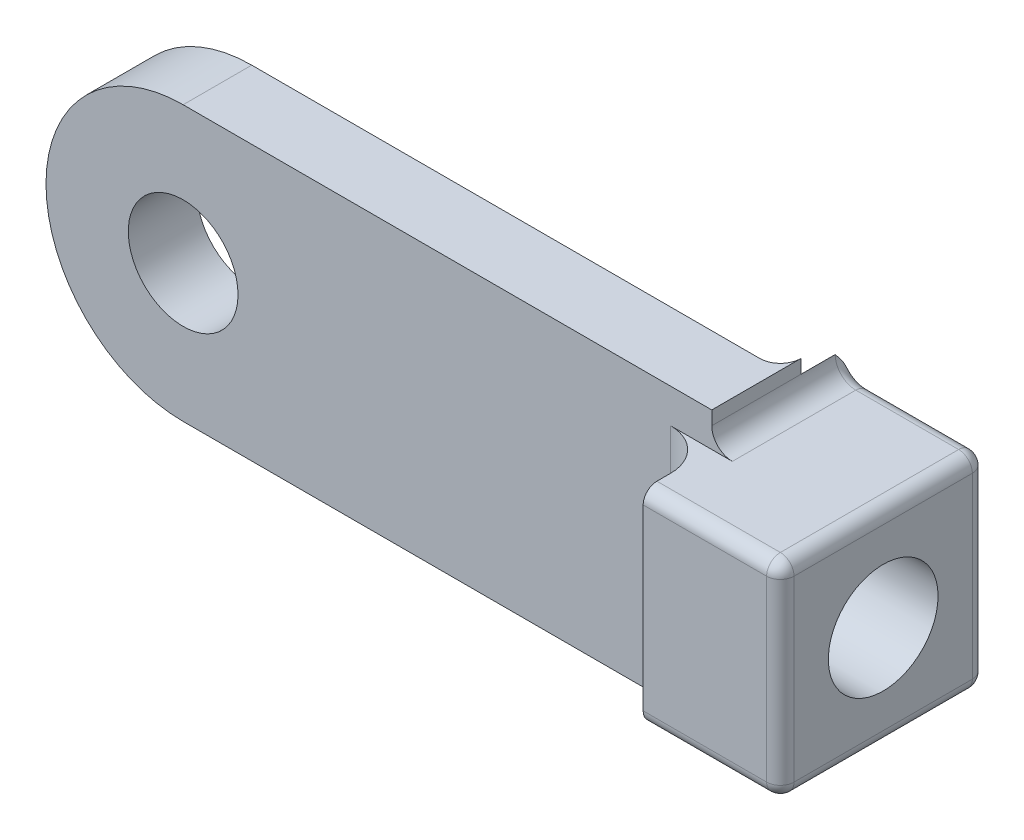
ISO-10303-21;
HEADER;
FILE_DESCRIPTION(('STEP AP214'),'2;1');
FILE_NAME('part.step','',(''),(''),'','','');
FILE_SCHEMA(('AUTOMOTIVE_DESIGN { 1 0 10303 214 1 1 1 1 }'));
ENDSEC;
DATA;
#1=APPLICATION_CONTEXT('core data for automotive mechanical design processes');
#2=APPLICATION_PROTOCOL_DEFINITION('international standard','automotive_design',2000,#1);
#3=PRODUCT_CONTEXT('',#1,'mechanical');
#4=PRODUCT('Part','Part','',(#3));
#5=PRODUCT_RELATED_PRODUCT_CATEGORY('part','',(#4));
#6=PRODUCT_DEFINITION_FORMATION('','',#4);
#7=PRODUCT_DEFINITION_CONTEXT('part definition',#1,'design');
#8=PRODUCT_DEFINITION('design','',#6,#7);
#9=PRODUCT_DEFINITION_SHAPE('','',#8);
#10=(LENGTH_UNIT() NAMED_UNIT(*) SI_UNIT(.MILLI.,.METRE.));
#11=(NAMED_UNIT(*) PLANE_ANGLE_UNIT() SI_UNIT($,.RADIAN.));
#12=(NAMED_UNIT(*) SI_UNIT($,.STERADIAN.) SOLID_ANGLE_UNIT());
#13=UNCERTAINTY_MEASURE_WITH_UNIT(LENGTH_MEASURE(1.E-05),#10,'distance_accuracy_value','');
#14=(GEOMETRIC_REPRESENTATION_CONTEXT(3) GLOBAL_UNCERTAINTY_ASSIGNED_CONTEXT((#13)) GLOBAL_UNIT_ASSIGNED_CONTEXT((#10,
#11,#12)) REPRESENTATION_CONTEXT('',''));
#15=CARTESIAN_POINT('',(0.,0.,0.));
#16=DIRECTION('',(0.,0.,1.));
#17=DIRECTION('',(1.,0.,0.));
#18=AXIS2_PLACEMENT_3D('',#15,#16,#17);
#19=CARTESIAN_POINT('',(16.0415717466549,10.,0.));
#20=DIRECTION('',(-1.,0.,0.));
#21=DIRECTION('',(0.,0.,1.));
#22=AXIS2_PLACEMENT_3D('',#19,#20,#21);
#23=PLANE('',#22);
#24=DIRECTION('',(0.,0.,1.));
#25=VECTOR('',#24,1.);
#26=CARTESIAN_POINT('',(16.0415717466549,-10.,0.));
#27=LINE('',#26,#25);
#28=CARTESIAN_POINT('',(16.0415717466549,-10.,-1.49999580710284));
#29=VERTEX_POINT('',#28);
#30=CARTESIAN_POINT('',(16.0415717466549,-10.,5.));
#31=VERTEX_POINT('',#30);
#32=EDGE_CURVE('E188',#29,#31,#27,.T.);
#33=ORIENTED_EDGE('',*,*,#32,.F.);
#34=DIRECTION('',(0.,1.,0.));
#35=VECTOR('',#34,1.);
#36=CARTESIAN_POINT('',(16.0415717466549,-9.49999999999999,-1.5));
#37=LINE('',#36,#35);
#38=CARTESIAN_POINT('',(16.0415717466549,-8.99999550621474,-1.5));
#39=VERTEX_POINT('',#38);
#40=EDGE_CURVE('E261',#29,#39,#37,.T.);
#41=ORIENTED_EDGE('',*,*,#40,.T.);
#42=DIRECTION('',(0.,0.,-1.));
#43=VECTOR('',#42,1.);
#44=CARTESIAN_POINT('',(16.0415717466549,-9.,5.));
#45=LINE('',#44,#43);
#46=CARTESIAN_POINT('',(16.0415717466549,-9.,5.));
#47=VERTEX_POINT('',#46);
#48=EDGE_CURVE('E191',#39,#47,#45,.F.);
#49=ORIENTED_EDGE('',*,*,#48,.T.);
#50=DIRECTION('',(0.,-1.,0.));
#51=VECTOR('',#50,1.);
#52=CARTESIAN_POINT('',(16.0415717466549,10.,5.));
#53=LINE('',#52,#51);
#54=EDGE_CURVE('E185',#47,#31,#53,.T.);
#55=ORIENTED_EDGE('',*,*,#54,.T.);
#56=EDGE_LOOP('',(#33,#41,#49,#55));
#57=FACE_BOUND('',#56,.T.);
#58=ADVANCED_FACE('F35',(#57),#23,.F.);
#59=CARTESIAN_POINT('',(16.0415717466549,10.,5.));
#60=VERTEX_POINT('',#59);
#61=CARTESIAN_POINT('',(16.0415717466549,9.,5.));
#62=VERTEX_POINT('',#61);
#63=EDGE_CURVE('E195',#60,#62,#53,.T.);
#64=ORIENTED_EDGE('',*,*,#63,.T.);
#65=DIRECTION('',(0.,0.,1.));
#66=VECTOR('',#65,1.);
#67=CARTESIAN_POINT('',(16.0415717466549,9.00000000000001,0.));
#68=LINE('',#67,#66);
#69=CARTESIAN_POINT('',(16.0415717466549,8.99999550621461,-1.5));
#70=VERTEX_POINT('',#69);
#71=EDGE_CURVE('E237',#62,#70,#68,.F.);
#72=ORIENTED_EDGE('',*,*,#71,.T.);
#73=DIRECTION('',(0.,1.,0.));
#74=VECTOR('',#73,1.);
#75=CARTESIAN_POINT('',(16.0415717466549,9.50000000000001,-1.5));
#76=LINE('',#75,#74);
#77=CARTESIAN_POINT('',(16.0415717466549,10.,-1.49999580708296));
#78=VERTEX_POINT('',#77);
#79=EDGE_CURVE('E263',#70,#78,#76,.T.);
#80=ORIENTED_EDGE('',*,*,#79,.T.);
#81=DIRECTION('',(0.,0.,1.));
#82=VECTOR('',#81,1.);
#83=CARTESIAN_POINT('',(16.0415717466549,10.,0.));
#84=LINE('',#83,#82);
#85=EDGE_CURVE('E207',#78,#60,#84,.T.);
#86=ORIENTED_EDGE('',*,*,#85,.T.);
#87=EDGE_LOOP('',(#64,#72,#80,#86));
#88=FACE_BOUND('',#87,.T.);
#89=ADVANCED_FACE('F358',(#88),#23,.F.);
#90=CARTESIAN_POINT('',(-22.5,0.,5.));
#91=DIRECTION('',(0.,0.,1.));
#92=DIRECTION('',(1.,0.,0.));
#93=AXIS2_PLACEMENT_3D('',#90,#91,#92);
#94=PLANE('',#93);
#95=DIRECTION('',(1.,0.,0.));
#96=VECTOR('',#95,1.);
#97=CARTESIAN_POINT('',(26.0415717466549,-7.5,5.));
#98=LINE('',#97,#96);
#99=CARTESIAN_POINT('',(13.0415717466549,-7.5,5.));
#100=VERTEX_POINT('',#99);
#101=CARTESIAN_POINT('',(17.5415717466549,-7.5,5.));
#102=VERTEX_POINT('',#101);
#103=EDGE_CURVE('E240',#100,#102,#98,.T.);
#104=ORIENTED_EDGE('',*,*,#103,.F.);
#105=DIRECTION('',(0.,-1.,0.));
#106=VECTOR('',#105,1.);
#107=CARTESIAN_POINT('',(13.0415717466549,0.,5.));
#108=LINE('',#107,#106);
#109=CARTESIAN_POINT('',(13.0415717466549,7.5,5.));
#110=VERTEX_POINT('',#109);
#111=EDGE_CURVE('E271',#100,#110,#108,.F.);
#112=ORIENTED_EDGE('',*,*,#111,.T.);
#113=DIRECTION('',(-1.,0.,0.));
#114=VECTOR('',#113,1.);
#115=CARTESIAN_POINT('',(26.0415717466549,7.5,5.));
#116=LINE('',#115,#114);
#117=CARTESIAN_POINT('',(17.5415717466549,7.5,5.));
#118=VERTEX_POINT('',#117);
#119=EDGE_CURVE('E233',#118,#110,#116,.T.);
#120=ORIENTED_EDGE('',*,*,#119,.F.);
#121=CARTESIAN_POINT('',(17.5415717466549,9.,5.));
#122=DIRECTION('',(0.,0.,1.));
#123=DIRECTION('',(1.,0.,0.));
#124=AXIS2_PLACEMENT_3D('',#121,#122,#123);
#125=CIRCLE('',#124,1.5);
#126=EDGE_CURVE('E251',#118,#62,#125,.F.);
#127=ORIENTED_EDGE('',*,*,#126,.T.);
#128=ORIENTED_EDGE('',*,*,#63,.F.);
#129=DIRECTION('',(-1.,0.,0.));
#130=VECTOR('',#129,1.);
#131=CARTESIAN_POINT('',(-22.5,10.,5.));
#132=LINE('',#131,#130);
#133=CARTESIAN_POINT('',(-22.5,10.,5.));
#134=VERTEX_POINT('',#133);
#135=EDGE_CURVE('E214',#60,#134,#132,.T.);
#136=ORIENTED_EDGE('',*,*,#135,.T.);
#137=CARTESIAN_POINT('',(-22.5,0.,5.));
#138=DIRECTION('',(0.,0.,1.));
#139=DIRECTION('',(1.,0.,0.));
#140=AXIS2_PLACEMENT_3D('',#137,#138,#139);
#141=CIRCLE('',#140,10.);
#142=CARTESIAN_POINT('',(-22.5,-10.,5.));
#143=VERTEX_POINT('',#142);
#144=EDGE_CURVE('E212',#134,#143,#141,.T.);
#145=ORIENTED_EDGE('',*,*,#144,.T.);
#146=DIRECTION('',(1.,0.,0.));
#147=VECTOR('',#146,1.);
#148=CARTESIAN_POINT('',(-22.5,-10.,5.));
#149=LINE('',#148,#147);
#150=EDGE_CURVE('E202',#143,#31,#149,.T.);
#151=ORIENTED_EDGE('',*,*,#150,.T.);
#152=ORIENTED_EDGE('',*,*,#54,.F.);
#153=CARTESIAN_POINT('',(17.5415717466549,-9.,5.));
#154=DIRECTION('',(0.,0.,1.));
#155=DIRECTION('',(1.,0.,0.));
#156=AXIS2_PLACEMENT_3D('',#153,#154,#155);
#157=CIRCLE('',#156,1.5);
#158=EDGE_CURVE('E258',#47,#102,#157,.F.);
#159=ORIENTED_EDGE('',*,*,#158,.T.);
#160=EDGE_LOOP('',(#104,#112,#120,#127,#128,#136,#145,#151,#152,#159));
#161=FACE_BOUND('',#160,.T.);
#162=CARTESIAN_POINT('',(-22.5,0.,5.));
#163=DIRECTION('',(0.,0.,1.));
#164=DIRECTION('',(1.,0.,0.));
#165=AXIS2_PLACEMENT_3D('',#162,#163,#164);
#166=CIRCLE('',#165,4.);
#167=CARTESIAN_POINT('',(-18.5,0.,5.));
#168=VERTEX_POINT('',#167);
#169=EDGE_CURVE('E226',#168,#168,#166,.T.);
#170=ORIENTED_EDGE('',*,*,#169,.F.);
#171=EDGE_LOOP('',(#170));
#172=FACE_BOUND('',#171,.T.);
#173=ADVANCED_FACE('F209',(#161,#172),#94,.T.);
#174=CARTESIAN_POINT('',(-22.5,0.,0.));
#175=DIRECTION('',(0.,0.,1.));
#176=DIRECTION('',(1.,0.,0.));
#177=AXIS2_PLACEMENT_3D('',#174,#175,#176);
#178=PLANE('',#177);
#179=DIRECTION('',(-1.,0.,0.));
#180=VECTOR('',#179,1.);
#181=CARTESIAN_POINT('',(-22.5,10.,0.));
#182=LINE('',#181,#180);
#183=CARTESIAN_POINT('',(14.5415717466549,10.,0.));
#184=VERTEX_POINT('',#183);
#185=CARTESIAN_POINT('',(-22.5,10.,0.));
#186=VERTEX_POINT('',#185);
#187=EDGE_CURVE('E218',#184,#186,#182,.T.);
#188=ORIENTED_EDGE('',*,*,#187,.F.);
#189=DIRECTION('',(0.,-1.,0.));
#190=VECTOR('',#189,1.);
#191=CARTESIAN_POINT('',(14.5415717466549,-7.5,0.));
#192=LINE('',#191,#190);
#193=CARTESIAN_POINT('',(14.5415717466549,-9.99999999999999,0.));
#194=VERTEX_POINT('',#193);
#195=EDGE_CURVE('E247',#184,#194,#192,.T.);
#196=ORIENTED_EDGE('',*,*,#195,.T.);
#197=DIRECTION('',(1.,0.,0.));
#198=VECTOR('',#197,1.);
#199=CARTESIAN_POINT('',(-22.5,-10.,0.));
#200=LINE('',#199,#198);
#201=CARTESIAN_POINT('',(-22.5,-10.,0.));
#202=VERTEX_POINT('',#201);
#203=EDGE_CURVE('E225',#202,#194,#200,.T.);
#204=ORIENTED_EDGE('',*,*,#203,.F.);
#205=CARTESIAN_POINT('',(-22.5,0.,0.));
#206=DIRECTION('',(0.,0.,1.));
#207=DIRECTION('',(1.,0.,0.));
#208=AXIS2_PLACEMENT_3D('',#205,#206,#207);
#209=CIRCLE('',#208,10.);
#210=EDGE_CURVE('E222',#186,#202,#209,.T.);
#211=ORIENTED_EDGE('',*,*,#210,.F.);
#212=EDGE_LOOP('',(#188,#196,#204,#211));
#213=FACE_BOUND('',#212,.T.);
#214=CARTESIAN_POINT('',(-22.5,0.,0.));
#215=DIRECTION('',(0.,0.,1.));
#216=DIRECTION('',(1.,0.,0.));
#217=AXIS2_PLACEMENT_3D('',#214,#215,#216);
#218=CIRCLE('',#217,4.);
#219=CARTESIAN_POINT('',(-18.5,0.,0.));
#220=VERTEX_POINT('',#219);
#221=EDGE_CURVE('E535',#220,#220,#218,.T.);
#222=ORIENTED_EDGE('',*,*,#221,.T.);
#223=EDGE_LOOP('',(#222));
#224=FACE_BOUND('',#223,.T.);
#225=ADVANCED_FACE('F376',(#213,#224),#178,.F.);
#226=CARTESIAN_POINT('',(-22.5,0.,5.));
#227=DIRECTION('',(0.,0.,-1.));
#228=DIRECTION('',(-1.,0.,0.));
#229=AXIS2_PLACEMENT_3D('',#226,#227,#228);
#230=CYLINDRICAL_SURFACE('',#229,10.);
#231=ORIENTED_EDGE('',*,*,#210,.T.);
#232=DIRECTION('',(0.,0.,-1.));
#233=VECTOR('',#232,1.);
#234=CARTESIAN_POINT('',(-22.5,-10.,5.));
#235=LINE('',#234,#233);
#236=EDGE_CURVE('E231',#143,#202,#235,.T.);
#237=ORIENTED_EDGE('',*,*,#236,.F.);
#238=ORIENTED_EDGE('',*,*,#144,.F.);
#239=DIRECTION('',(0.,0.,-1.));
#240=VECTOR('',#239,1.);
#241=CARTESIAN_POINT('',(-22.5,10.,5.));
#242=LINE('',#241,#240);
#243=EDGE_CURVE('E216',#134,#186,#242,.T.);
#244=ORIENTED_EDGE('',*,*,#243,.T.);
#245=EDGE_LOOP('',(#231,#237,#238,#244));
#246=FACE_BOUND('',#245,.T.);
#247=ADVANCED_FACE('F379',(#246),#230,.T.);
#248=CARTESIAN_POINT('',(-22.5,-10.,5.));
#249=DIRECTION('',(0.,1.,0.));
#250=DIRECTION('',(-1.,0.,0.));
#251=AXIS2_PLACEMENT_3D('',#248,#249,#250);
#252=PLANE('',#251);
#253=ORIENTED_EDGE('',*,*,#203,.T.);
#254=CARTESIAN_POINT('',(14.5415717466549,-9.99999999999999,-1.5));
#255=DIRECTION('',(0.,1.,0.));
#256=DIRECTION('',(-1.,0.,0.));
#257=AXIS2_PLACEMENT_3D('',#254,#255,#256);
#258=CIRCLE('',#257,1.5);
#259=EDGE_CURVE('E205',#194,#29,#258,.T.);
#260=ORIENTED_EDGE('',*,*,#259,.T.);
#261=ORIENTED_EDGE('',*,*,#32,.T.);
#262=ORIENTED_EDGE('',*,*,#150,.F.);
#263=ORIENTED_EDGE('',*,*,#236,.T.);
#264=EDGE_LOOP('',(#253,#260,#261,#262,#263));
#265=FACE_BOUND('',#264,.T.);
#266=ADVANCED_FACE('F200',(#265),#252,.F.);
#267=CARTESIAN_POINT('',(-22.5,10.,5.));
#268=DIRECTION('',(0.,-1.,0.));
#269=DIRECTION('',(1.,0.,0.));
#270=AXIS2_PLACEMENT_3D('',#267,#268,#269);
#271=PLANE('',#270);
#272=ORIENTED_EDGE('',*,*,#135,.F.);
#273=ORIENTED_EDGE('',*,*,#85,.F.);
#274=CARTESIAN_POINT('',(14.5415717466549,10.,-1.5));
#275=DIRECTION('',(0.,-1.,0.));
#276=DIRECTION('',(1.,0.,0.));
#277=AXIS2_PLACEMENT_3D('',#274,#275,#276);
#278=CIRCLE('',#277,1.5);
#279=EDGE_CURVE('E266',#78,#184,#278,.T.);
#280=ORIENTED_EDGE('',*,*,#279,.T.);
#281=ORIENTED_EDGE('',*,*,#187,.T.);
#282=ORIENTED_EDGE('',*,*,#243,.F.);
#283=EDGE_LOOP('',(#272,#273,#280,#281,#282));
#284=FACE_BOUND('',#283,.T.);
#285=ADVANCED_FACE('F372',(#284),#271,.F.);
#286=CARTESIAN_POINT('',(-22.5,0.,5.));
#287=DIRECTION('',(0.,0.,-1.));
#288=DIRECTION('',(-1.,0.,0.));
#289=AXIS2_PLACEMENT_3D('',#286,#287,#288);
#290=CYLINDRICAL_SURFACE('',#289,4.);
#291=ORIENTED_EDGE('',*,*,#169,.T.);
#292=EDGE_LOOP('',(#291));
#293=FACE_BOUND('',#292,.T.);
#294=ORIENTED_EDGE('',*,*,#221,.F.);
#295=EDGE_LOOP('',(#294));
#296=FACE_BOUND('',#295,.T.);
#297=ADVANCED_FACE('F369',(#293,#296),#290,.F.);
#298=CARTESIAN_POINT('',(16.0415717466549,0.,0.));
#299=DIRECTION('',(1.,0.,0.));
#300=DIRECTION('',(0.,0.,-1.));
#301=AXIS2_PLACEMENT_3D('',#298,#299,#300);
#302=PLANE('',#301);
#303=DIRECTION('',(0.,0.,-1.));
#304=VECTOR('',#303,1.);
#305=CARTESIAN_POINT('',(16.0415717466549,-7.5,-5.));
#306=LINE('',#305,#304);
#307=CARTESIAN_POINT('',(16.0415717466549,-7.5,9.));
#308=VERTEX_POINT('',#307);
#309=CARTESIAN_POINT('',(16.0415717466549,-7.5,8.));
#310=VERTEX_POINT('',#309);
#311=EDGE_CURVE('E196',#308,#310,#306,.T.);
#312=ORIENTED_EDGE('',*,*,#311,.F.);
#313=CARTESIAN_POINT('',(16.0415717466549,-6.5,9.));
#314=DIRECTION('',(1.,0.,0.));
#315=DIRECTION('',(0.,0.,-1.));
#316=AXIS2_PLACEMENT_3D('',#313,#314,#315);
#317=CIRCLE('',#316,1.);
#318=CARTESIAN_POINT('',(16.0415717466549,-6.5,10.));
#319=VERTEX_POINT('',#318);
#320=EDGE_CURVE('E490',#308,#319,#317,.F.);
#321=ORIENTED_EDGE('',*,*,#320,.T.);
#322=DIRECTION('',(0.,-1.,0.));
#323=VECTOR('',#322,1.);
#324=CARTESIAN_POINT('',(16.0415717466549,-7.5,10.));
#325=LINE('',#324,#323);
#326=CARTESIAN_POINT('',(16.0415717466549,6.5,10.));
#327=VERTEX_POINT('',#326);
#328=EDGE_CURVE('E486',#327,#319,#325,.T.);
#329=ORIENTED_EDGE('',*,*,#328,.F.);
#330=CARTESIAN_POINT('',(16.0415717466549,6.5,9.00000000000001));
#331=DIRECTION('',(1.,0.,0.));
#332=DIRECTION('',(0.,0.,-1.));
#333=AXIS2_PLACEMENT_3D('',#330,#331,#332);
#334=CIRCLE('',#333,1.);
#335=CARTESIAN_POINT('',(16.0415717466549,7.5,9.00000000000001));
#336=VERTEX_POINT('',#335);
#337=EDGE_CURVE('E494',#327,#336,#334,.F.);
#338=ORIENTED_EDGE('',*,*,#337,.T.);
#339=DIRECTION('',(0.,0.,1.));
#340=VECTOR('',#339,1.);
#341=CARTESIAN_POINT('',(16.0415717466549,7.50000000000001,-5.));
#342=LINE('',#341,#340);
#343=CARTESIAN_POINT('',(16.0415717466549,7.5,8.));
#344=VERTEX_POINT('',#343);
#345=EDGE_CURVE('E526',#344,#336,#342,.T.);
#346=ORIENTED_EDGE('',*,*,#345,.F.);
#347=DIRECTION('',(0.,-1.,0.));
#348=VECTOR('',#347,1.);
#349=CARTESIAN_POINT('',(16.0415717466549,0.,8.));
#350=LINE('',#349,#348);
#351=EDGE_CURVE('E268',#344,#310,#350,.T.);
#352=ORIENTED_EDGE('',*,*,#351,.T.);
#353=EDGE_LOOP('',(#312,#321,#329,#338,#346,#352));
#354=FACE_BOUND('',#353,.T.);
#355=ADVANCED_FACE('F371',(#354),#302,.F.);
#356=CARTESIAN_POINT('',(26.0415717466549,-7.5,-5.));
#357=DIRECTION('',(0.,0.,1.));
#358=DIRECTION('',(0.,-1.,0.));
#359=AXIS2_PLACEMENT_3D('',#356,#357,#358);
#360=PLANE('',#359);
#361=DIRECTION('',(-1.,0.,0.));
#362=VECTOR('',#361,1.);
#363=CARTESIAN_POINT('',(26.0415717466549,6.50000000000001,-5.));
#364=LINE('',#363,#362);
#365=CARTESIAN_POINT('',(17.5415717466549,6.50000000000001,-5.));
#366=VERTEX_POINT('',#365);
#367=CARTESIAN_POINT('',(25.0415717466549,6.50000000000001,-5.));
#368=VERTEX_POINT('',#367);
#369=EDGE_CURVE('E279',#366,#368,#364,.F.);
#370=ORIENTED_EDGE('',*,*,#369,.T.);
#371=DIRECTION('',(0.,1.,0.));
#372=VECTOR('',#371,1.);
#373=CARTESIAN_POINT('',(25.0415717466549,-6.5,-5.));
#374=LINE('',#373,#372);
#375=CARTESIAN_POINT('',(25.0415717466549,-6.5,-5.));
#376=VERTEX_POINT('',#375);
#377=EDGE_CURVE('E444',#368,#376,#374,.F.);
#378=ORIENTED_EDGE('',*,*,#377,.T.);
#379=DIRECTION('',(-1.,0.,0.));
#380=VECTOR('',#379,1.);
#381=CARTESIAN_POINT('',(26.0415717466549,-6.5,-5.));
#382=LINE('',#381,#380);
#383=CARTESIAN_POINT('',(17.5415717466549,-6.5,-5.));
#384=VERTEX_POINT('',#383);
#385=EDGE_CURVE('E285',#376,#384,#382,.T.);
#386=ORIENTED_EDGE('',*,*,#385,.T.);
#387=CARTESIAN_POINT('',(17.5415717466549,-9.,-5.));
#388=DIRECTION('',(0.,0.,1.));
#389=DIRECTION('',(0.,-1.,0.));
#390=AXIS2_PLACEMENT_3D('',#387,#388,#389);
#391=CIRCLE('',#390,2.5);
#392=CARTESIAN_POINT('',(16.0415717466549,-7.,-5.));
#393=VERTEX_POINT('',#392);
#394=EDGE_CURVE('E287',#384,#393,#391,.T.);
#395=ORIENTED_EDGE('',*,*,#394,.T.);
#396=DIRECTION('',(0.,1.,0.));
#397=VECTOR('',#396,1.);
#398=CARTESIAN_POINT('',(16.0415717466549,-7.5,-5.));
#399=LINE('',#398,#397);
#400=CARTESIAN_POINT('',(16.0415717466549,7.00000000000001,-5.));
#401=VERTEX_POINT('',#400);
#402=EDGE_CURVE('E507',#393,#401,#399,.T.);
#403=ORIENTED_EDGE('',*,*,#402,.T.);
#404=CARTESIAN_POINT('',(17.5415717466549,9.00000000000001,-5.));
#405=DIRECTION('',(0.,0.,1.));
#406=DIRECTION('',(0.,-1.,0.));
#407=AXIS2_PLACEMENT_3D('',#404,#405,#406);
#408=CIRCLE('',#407,2.5);
#409=EDGE_CURVE('E282',#401,#366,#408,.T.);
#410=ORIENTED_EDGE('',*,*,#409,.T.);
#411=EDGE_LOOP('',(#370,#378,#386,#395,#403,#410));
#412=FACE_BOUND('',#411,.T.);
#413=ADVANCED_FACE('F367',(#412),#360,.F.);
#414=CARTESIAN_POINT('',(26.0415717466549,7.50000000000001,-5.));
#415=DIRECTION('',(0.,-1.,0.));
#416=DIRECTION('',(0.,0.,-1.));
#417=AXIS2_PLACEMENT_3D('',#414,#415,#416);
#418=PLANE('',#417);
#419=DIRECTION('',(-1.,0.,0.));
#420=VECTOR('',#419,1.);
#421=CARTESIAN_POINT('',(26.0415717466549,7.5,9.00000000000001));
#422=LINE('',#421,#420);
#423=CARTESIAN_POINT('',(25.0415717466549,7.5,9.00000000000001));
#424=VERTEX_POINT('',#423);
#425=EDGE_CURVE('E429',#336,#424,#422,.F.);
#426=ORIENTED_EDGE('',*,*,#425,.T.);
#427=DIRECTION('',(0.,0.,1.));
#428=VECTOR('',#427,1.);
#429=CARTESIAN_POINT('',(25.0415717466549,7.50000000000001,-4.));
#430=LINE('',#429,#428);
#431=CARTESIAN_POINT('',(25.0415717466549,7.50000000000001,-4.));
#432=VERTEX_POINT('',#431);
#433=EDGE_CURVE('E11',#424,#432,#430,.F.);
#434=ORIENTED_EDGE('',*,*,#433,.T.);
#435=DIRECTION('',(-1.,0.,0.));
#436=VECTOR('',#435,1.);
#437=CARTESIAN_POINT('',(26.0415717466549,7.50000000000001,-4.));
#438=LINE('',#437,#436);
#439=CARTESIAN_POINT('',(17.5415717466549,7.50000000000001,-4.));
#440=VERTEX_POINT('',#439);
#441=EDGE_CURVE('E487',#432,#440,#438,.T.);
#442=ORIENTED_EDGE('',*,*,#441,.T.);
#443=DIRECTION('',(0.,0.,1.));
#444=VECTOR('',#443,1.);
#445=CARTESIAN_POINT('',(17.5415717466549,7.5,5.));
#446=LINE('',#445,#444);
#447=EDGE_CURVE('E235',#440,#118,#446,.T.);
#448=ORIENTED_EDGE('',*,*,#447,.T.);
#449=ORIENTED_EDGE('',*,*,#119,.T.);
#450=CARTESIAN_POINT('',(13.0415717466549,7.5,8.));
#451=DIRECTION('',(0.,-1.,0.));
#452=DIRECTION('',(0.,0.,-1.));
#453=AXIS2_PLACEMENT_3D('',#450,#451,#452);
#454=CIRCLE('',#453,3.);
#455=EDGE_CURVE('E277',#110,#344,#454,.T.);
#456=ORIENTED_EDGE('',*,*,#455,.T.);
#457=ORIENTED_EDGE('',*,*,#345,.T.);
#458=EDGE_LOOP('',(#426,#434,#442,#448,#449,#456,#457));
#459=FACE_BOUND('',#458,.T.);
#460=ADVANCED_FACE('F550',(#459),#418,.F.);
#461=CARTESIAN_POINT('',(26.0415717466549,-7.5,10.));
#462=DIRECTION('',(0.,0.,-1.));
#463=DIRECTION('',(0.,1.,0.));
#464=AXIS2_PLACEMENT_3D('',#461,#462,#463);
#465=PLANE('',#464);
#466=DIRECTION('',(-1.,0.,0.));
#467=VECTOR('',#466,1.);
#468=CARTESIAN_POINT('',(26.0415717466549,-6.5,10.));
#469=LINE('',#468,#467);
#470=CARTESIAN_POINT('',(25.0415717466549,-6.5,10.));
#471=VERTEX_POINT('',#470);
#472=EDGE_CURVE('E481',#319,#471,#469,.F.);
#473=ORIENTED_EDGE('',*,*,#472,.T.);
#474=DIRECTION('',(0.,-1.,0.));
#475=VECTOR('',#474,1.);
#476=CARTESIAN_POINT('',(25.0415717466549,6.5,10.));
#477=LINE('',#476,#475);
#478=CARTESIAN_POINT('',(25.0415717466549,6.5,10.));
#479=VERTEX_POINT('',#478);
#480=EDGE_CURVE('E59',#471,#479,#477,.F.);
#481=ORIENTED_EDGE('',*,*,#480,.T.);
#482=DIRECTION('',(-1.,0.,0.));
#483=VECTOR('',#482,1.);
#484=CARTESIAN_POINT('',(26.0415717466549,6.5,10.));
#485=LINE('',#484,#483);
#486=EDGE_CURVE('E488',#479,#327,#485,.T.);
#487=ORIENTED_EDGE('',*,*,#486,.T.);
#488=ORIENTED_EDGE('',*,*,#328,.T.);
#489=EDGE_LOOP('',(#473,#481,#487,#488));
#490=FACE_BOUND('',#489,.T.);
#491=ADVANCED_FACE('F484',(#490),#465,.F.);
#492=CARTESIAN_POINT('',(26.0415717466549,-7.5,-5.));
#493=DIRECTION('',(0.,1.,0.));
#494=DIRECTION('',(0.,0.,1.));
#495=AXIS2_PLACEMENT_3D('',#492,#493,#494);
#496=PLANE('',#495);
#497=DIRECTION('',(-1.,0.,0.));
#498=VECTOR('',#497,1.);
#499=CARTESIAN_POINT('',(26.0415717466549,-7.5,-4.));
#500=LINE('',#499,#498);
#501=CARTESIAN_POINT('',(17.5415717466549,-7.5,-4.));
#502=VERTEX_POINT('',#501);
#503=CARTESIAN_POINT('',(25.0415717466549,-7.5,-4.));
#504=VERTEX_POINT('',#503);
#505=EDGE_CURVE('E496',#502,#504,#500,.F.);
#506=ORIENTED_EDGE('',*,*,#505,.T.);
#507=DIRECTION('',(0.,0.,-1.));
#508=VECTOR('',#507,1.);
#509=CARTESIAN_POINT('',(25.0415717466549,-7.5,9.));
#510=LINE('',#509,#508);
#511=CARTESIAN_POINT('',(25.0415717466549,-7.5,9.));
#512=VERTEX_POINT('',#511);
#513=EDGE_CURVE('E448',#504,#512,#510,.F.);
#514=ORIENTED_EDGE('',*,*,#513,.T.);
#515=DIRECTION('',(-1.,0.,0.));
#516=VECTOR('',#515,1.);
#517=CARTESIAN_POINT('',(26.0415717466549,-7.5,9.));
#518=LINE('',#517,#516);
#519=EDGE_CURVE('E482',#512,#308,#518,.T.);
#520=ORIENTED_EDGE('',*,*,#519,.T.);
#521=ORIENTED_EDGE('',*,*,#311,.T.);
#522=CARTESIAN_POINT('',(13.0415717466549,-7.5,8.));
#523=DIRECTION('',(0.,1.,0.));
#524=DIRECTION('',(0.,0.,1.));
#525=AXIS2_PLACEMENT_3D('',#522,#523,#524);
#526=CIRCLE('',#525,3.);
#527=EDGE_CURVE('E274',#310,#100,#526,.T.);
#528=ORIENTED_EDGE('',*,*,#527,.T.);
#529=ORIENTED_EDGE('',*,*,#103,.T.);
#530=DIRECTION('',(0.,0.,-1.));
#531=VECTOR('',#530,1.);
#532=CARTESIAN_POINT('',(17.5415717466549,-7.5,0.));
#533=LINE('',#532,#531);
#534=EDGE_CURVE('E243',#102,#502,#533,.T.);
#535=ORIENTED_EDGE('',*,*,#534,.T.);
#536=EDGE_LOOP('',(#506,#514,#520,#521,#528,#529,#535));
#537=FACE_BOUND('',#536,.T.);
#538=ADVANCED_FACE('F562',(#537),#496,.F.);
#539=CARTESIAN_POINT('',(26.0415717466549,0.,0.));
#540=DIRECTION('',(1.,0.,0.));
#541=DIRECTION('',(0.,0.,-1.));
#542=AXIS2_PLACEMENT_3D('',#539,#540,#541);
#543=PLANE('',#542);
#544=DIRECTION('',(0.,0.,-1.));
#545=VECTOR('',#544,1.);
#546=CARTESIAN_POINT('',(26.0415717466549,-6.5,-4.));
#547=LINE('',#546,#545);
#548=CARTESIAN_POINT('',(26.0415717466549,-6.5,9.));
#549=VERTEX_POINT('',#548);
#550=CARTESIAN_POINT('',(26.0415717466549,-6.5,-4.));
#551=VERTEX_POINT('',#550);
#552=EDGE_CURVE('E439',#549,#551,#547,.T.);
#553=ORIENTED_EDGE('',*,*,#552,.T.);
#554=DIRECTION('',(0.,1.,0.));
#555=VECTOR('',#554,1.);
#556=CARTESIAN_POINT('',(26.0415717466549,6.50000000000001,-4.));
#557=LINE('',#556,#555);
#558=CARTESIAN_POINT('',(26.0415717466549,6.50000000000001,-4.));
#559=VERTEX_POINT('',#558);
#560=EDGE_CURVE('E441',#551,#559,#557,.T.);
#561=ORIENTED_EDGE('',*,*,#560,.T.);
#562=DIRECTION('',(0.,0.,1.));
#563=VECTOR('',#562,1.);
#564=CARTESIAN_POINT('',(26.0415717466549,6.5,9.00000000000001));
#565=LINE('',#564,#563);
#566=CARTESIAN_POINT('',(26.0415717466549,6.5,9.00000000000001));
#567=VERTEX_POINT('',#566);
#568=EDGE_CURVE('E435',#559,#567,#565,.T.);
#569=ORIENTED_EDGE('',*,*,#568,.T.);
#570=DIRECTION('',(0.,-1.,0.));
#571=VECTOR('',#570,1.);
#572=CARTESIAN_POINT('',(26.0415717466549,-6.5,9.));
#573=LINE('',#572,#571);
#574=EDGE_CURVE('E437',#567,#549,#573,.T.);
#575=ORIENTED_EDGE('',*,*,#574,.T.);
#576=EDGE_LOOP('',(#553,#561,#569,#575));
#577=FACE_BOUND('',#576,.T.);
#578=CARTESIAN_POINT('',(26.0415717466549,0.,2.5));
#579=DIRECTION('',(1.,0.,0.));
#580=DIRECTION('',(0.,0.,-1.));
#581=AXIS2_PLACEMENT_3D('',#578,#579,#580);
#582=CIRCLE('',#581,4.);
#583=CARTESIAN_POINT('',(26.0415717466549,0.,-1.5));
#584=VERTEX_POINT('',#583);
#585=EDGE_CURVE('E421',#584,#584,#582,.T.);
#586=ORIENTED_EDGE('',*,*,#585,.F.);
#587=EDGE_LOOP('',(#586));
#588=FACE_BOUND('',#587,.T.);
#589=ADVANCED_FACE('F570',(#577,#588),#543,.T.);
#590=ORIENTED_EDGE('',*,*,#402,.F.);
#591=CARTESIAN_POINT('',(16.0415717466549,-7.,-5.));
#592=CARTESIAN_POINT('',(16.0415717466549,-7.08513217520495,-4.99999672641102));
#593=CARTESIAN_POINT('',(16.0415717466549,-7.16994395834381,-4.99305736034905));
#594=CARTESIAN_POINT('',(16.0415717466549,-7.33696549733399,-4.96745346128666));
#595=CARTESIAN_POINT('',(16.0415717466549,-7.41919266694012,-4.94890525307254));
#596=CARTESIAN_POINT('',(16.0415717466549,-7.63985028177891,-4.88506931466276));
#597=CARTESIAN_POINT('',(16.0415717466549,-7.77544787582178,-4.83014630781457));
#598=CARTESIAN_POINT('',(16.0415717466549,-8.03731604526741,-4.70047802516431));
#599=CARTESIAN_POINT('',(16.0415717466549,-8.16351982992734,-4.62560547409419));
#600=CARTESIAN_POINT('',(16.0415717466549,-8.40961744089548,-4.46271641453321));
#601=CARTESIAN_POINT('',(16.0415717466549,-8.52938758052345,-4.37451890146586));
#602=CARTESIAN_POINT('',(16.0415717466549,-8.76411409535404,-4.1925214930186));
#603=CARTESIAN_POINT('',(16.0415717466549,-8.87907804257776,-4.09873102220359));
#604=CARTESIAN_POINT('',(16.0415717466549,-8.99600000074969,-4.00326598415953));
#605=CARTESIAN_POINT('',(16.0415717466549,-8.99800000077663,-4.00163299093263));
#606=CARTESIAN_POINT('',(16.0415717466549,-9.,-4.));
#607=B_SPLINE_CURVE_WITH_KNOTS('',3,(#591,#592,#593,#594,#595,#596,#597,#598,#599,#600,#601,
#602,#603,#604,#605,#606),.UNSPECIFIED.,.F.,.F.,(4,2,2,2,2,2,2,4),(0.,0.254640204008816,
0.506768796978762,0.943118487485662,1.38232160287476,1.82814064761548,2.27322859135588,
2.28097455804858),.UNSPECIFIED.);
#608=CARTESIAN_POINT('',(16.0415717466549,-9.,-4.));
#609=VERTEX_POINT('',#608);
#610=EDGE_CURVE('E297',#393,#609,#607,.T.);
#611=ORIENTED_EDGE('',*,*,#610,.T.);
#612=DIRECTION('',(0.,0.,1.));
#613=VECTOR('',#612,1.);
#614=CARTESIAN_POINT('',(16.0415717466549,-9.,-3.25));
#615=LINE('',#614,#613);
#616=EDGE_CURVE('E256',#609,#39,#615,.T.);
#617=ORIENTED_EDGE('',*,*,#616,.T.);
#618=DIRECTION('',(0.,-1.,0.));
#619=VECTOR('',#618,1.);
#620=CARTESIAN_POINT('',(16.0415717466549,7.50000000000001,-1.5));
#621=LINE('',#620,#619);
#622=EDGE_CURVE('E249',#39,#70,#621,.F.);
#623=ORIENTED_EDGE('',*,*,#622,.T.);
#624=DIRECTION('',(0.,0.,-1.));
#625=VECTOR('',#624,1.);
#626=CARTESIAN_POINT('',(16.0415717466549,9.00000000000001,-3.25));
#627=LINE('',#626,#625);
#628=CARTESIAN_POINT('',(16.0415717466549,9.00000000000001,-4.));
#629=VERTEX_POINT('',#628);
#630=EDGE_CURVE('E253',#70,#629,#627,.T.);
#631=ORIENTED_EDGE('',*,*,#630,.T.);
#632=CARTESIAN_POINT('',(16.0415717466549,7.00000000000001,-5.));
#633=CARTESIAN_POINT('',(16.0415717466549,7.08513217520496,-4.99999672641101));
#634=CARTESIAN_POINT('',(16.0415717466549,7.16994395834381,-4.99305736034904));
#635=CARTESIAN_POINT('',(16.0415717466549,7.336965497334,-4.96745346128666));
#636=CARTESIAN_POINT('',(16.0415717466549,7.41919266694012,-4.94890525307254));
#637=CARTESIAN_POINT('',(16.0415717466549,7.63985028177892,-4.88506931466276));
#638=CARTESIAN_POINT('',(16.0415717466549,7.7754478758218,-4.83014630781457));
#639=CARTESIAN_POINT('',(16.0415717466549,8.03731604526743,-4.7004780251643));
#640=CARTESIAN_POINT('',(16.0415717466549,8.16351982992735,-4.62560547409418));
#641=CARTESIAN_POINT('',(16.0415717466549,8.4096174408955,-4.46271641453321));
#642=CARTESIAN_POINT('',(16.0415717466549,8.52938758052347,-4.37451890146588));
#643=CARTESIAN_POINT('',(16.0415717466549,8.76411409535404,-4.19252149301858));
#644=CARTESIAN_POINT('',(16.0415717466549,8.8790780425777,-4.09873102220351));
#645=CARTESIAN_POINT('',(16.0415717466549,8.9960000007497,-4.00326598415952));
#646=CARTESIAN_POINT('',(16.0415717466549,8.99800000077664,-4.00163299093263));
#647=CARTESIAN_POINT('',(16.0415717466549,9.00000000000001,-4.));
#648=B_SPLINE_CURVE_WITH_KNOTS('',3,(#632,#633,#634,#635,#636,#637,#638,#639,#640,#641,#642,
#643,#644,#645,#646,#647),.UNSPECIFIED.,.F.,.F.,(4,2,2,2,2,2,2,4),(0.,0.254640204008812,
0.506768796978762,0.943118487485669,1.38232160287476,1.82814064761548,2.27322859135588,
2.28097455804858),.UNSPECIFIED.);
#649=EDGE_CURVE('E290',#629,#401,#648,.F.);
#650=ORIENTED_EDGE('',*,*,#649,.T.);
#651=EDGE_LOOP('',(#590,#611,#617,#623,#631,#650));
#652=FACE_BOUND('',#651,.T.);
#653=ADVANCED_FACE('F303',(#652),#302,.F.);
#654=CARTESIAN_POINT('',(17.5415717466549,-9.,-5.));
#655=DIRECTION('',(0.,0.,1.));
#656=DIRECTION('',(0.,-1.,0.));
#657=AXIS2_PLACEMENT_3D('',#654,#655,#656);
#658=CYLINDRICAL_SURFACE('',#657,1.5);
#659=ORIENTED_EDGE('',*,*,#616,.F.);
#660=CARTESIAN_POINT('',(17.5415717466549,-9.,-4.));
#661=DIRECTION('',(0.,0.,1.));
#662=DIRECTION('',(0.,-1.,0.));
#663=AXIS2_PLACEMENT_3D('',#660,#661,#662);
#664=CIRCLE('',#663,1.5);
#665=EDGE_CURVE('E418',#609,#502,#664,.F.);
#666=ORIENTED_EDGE('',*,*,#665,.T.);
#667=ORIENTED_EDGE('',*,*,#534,.F.);
#668=ORIENTED_EDGE('',*,*,#158,.F.);
#669=ORIENTED_EDGE('',*,*,#48,.F.);
#670=EDGE_LOOP('',(#659,#666,#667,#668,#669));
#671=FACE_BOUND('',#670,.T.);
#672=ADVANCED_FACE('F397',(#671),#658,.F.);
#673=CARTESIAN_POINT('',(14.5415717466549,0.,-1.5));
#674=DIRECTION('',(0.,1.,0.));
#675=DIRECTION('',(0.,0.,1.));
#676=AXIS2_PLACEMENT_3D('',#673,#674,#675);
#677=CYLINDRICAL_SURFACE('',#676,1.5);
#678=ORIENTED_EDGE('',*,*,#279,.F.);
#679=ORIENTED_EDGE('',*,*,#79,.F.);
#680=ORIENTED_EDGE('',*,*,#622,.F.);
#681=ORIENTED_EDGE('',*,*,#40,.F.);
#682=ORIENTED_EDGE('',*,*,#259,.F.);
#683=ORIENTED_EDGE('',*,*,#195,.F.);
#684=EDGE_LOOP('',(#678,#679,#680,#681,#682,#683));
#685=FACE_BOUND('',#684,.T.);
#686=ADVANCED_FACE('F393',(#685),#677,.F.);
#687=CARTESIAN_POINT('',(17.5415717466549,9.00000000000001,-5.));
#688=DIRECTION('',(0.,0.,-1.));
#689=DIRECTION('',(0.,1.,0.));
#690=AXIS2_PLACEMENT_3D('',#687,#688,#689);
#691=CYLINDRICAL_SURFACE('',#690,1.5);
#692=ORIENTED_EDGE('',*,*,#447,.F.);
#693=CARTESIAN_POINT('',(17.5415717466549,9.00000000000001,-4.));
#694=DIRECTION('',(0.,0.,1.));
#695=DIRECTION('',(0.,-1.,0.));
#696=AXIS2_PLACEMENT_3D('',#693,#694,#695);
#697=CIRCLE('',#696,1.5);
#698=EDGE_CURVE('E500',#440,#629,#697,.F.);
#699=ORIENTED_EDGE('',*,*,#698,.T.);
#700=ORIENTED_EDGE('',*,*,#630,.F.);
#701=ORIENTED_EDGE('',*,*,#71,.F.);
#702=ORIENTED_EDGE('',*,*,#126,.F.);
#703=EDGE_LOOP('',(#692,#699,#700,#701,#702));
#704=FACE_BOUND('',#703,.T.);
#705=ADVANCED_FACE('F389',(#704),#691,.F.);
#706=CARTESIAN_POINT('',(13.0415717466549,0.,8.));
#707=DIRECTION('',(0.,-1.,0.));
#708=DIRECTION('',(0.,0.,-1.));
#709=AXIS2_PLACEMENT_3D('',#706,#707,#708);
#710=CYLINDRICAL_SURFACE('',#709,3.);
#711=ORIENTED_EDGE('',*,*,#455,.F.);
#712=ORIENTED_EDGE('',*,*,#111,.F.);
#713=ORIENTED_EDGE('',*,*,#527,.F.);
#714=ORIENTED_EDGE('',*,*,#351,.F.);
#715=EDGE_LOOP('',(#711,#712,#713,#714));
#716=FACE_BOUND('',#715,.T.);
#717=ADVANCED_FACE('F392',(#716),#710,.F.);
#718=CARTESIAN_POINT('',(18.0415717466549,0.,2.5));
#719=DIRECTION('',(1.,0.,0.));
#720=DIRECTION('',(0.,0.,-1.));
#721=AXIS2_PLACEMENT_3D('',#718,#719,#720);
#722=CYLINDRICAL_SURFACE('',#721,4.);
#723=CARTESIAN_POINT('',(18.0415717466549,0.,2.5));
#724=DIRECTION('',(1.,0.,0.));
#725=DIRECTION('',(0.,0.,-1.));
#726=AXIS2_PLACEMENT_3D('',#723,#724,#725);
#727=CIRCLE('',#726,4.);
#728=CARTESIAN_POINT('',(18.0415717466549,0.,-1.5));
#729=VERTEX_POINT('',#728);
#730=EDGE_CURVE('E425',#729,#729,#727,.T.);
#731=ORIENTED_EDGE('',*,*,#730,.F.);
#732=EDGE_LOOP('',(#731));
#733=FACE_BOUND('',#732,.T.);
#734=ORIENTED_EDGE('',*,*,#585,.T.);
#735=EDGE_LOOP('',(#734));
#736=FACE_BOUND('',#735,.T.);
#737=ADVANCED_FACE('F403',(#733,#736),#722,.F.);
#738=CARTESIAN_POINT('',(18.0415717466549,0.,2.5));
#739=DIRECTION('',(1.,0.,0.));
#740=DIRECTION('',(0.,0.,-1.));
#741=AXIS2_PLACEMENT_3D('',#738,#739,#740);
#742=PLANE('',#741);
#743=ORIENTED_EDGE('',*,*,#730,.T.);
#744=EDGE_LOOP('',(#743));
#745=FACE_BOUND('',#744,.T.);
#746=ADVANCED_FACE('F411',(#745),#742,.T.);
#747=CARTESIAN_POINT('',(26.0415717466549,-6.5,-4.));
#748=DIRECTION('',(-1.,0.,0.));
#749=DIRECTION('',(0.,0.,1.));
#750=AXIS2_PLACEMENT_3D('',#747,#748,#749);
#751=CYLINDRICAL_SURFACE('',#750,1.);
#752=ORIENTED_EDGE('',*,*,#385,.F.);
#753=CARTESIAN_POINT('',(25.0415717466549,-6.5,-4.));
#754=DIRECTION('',(-1.,0.,0.));
#755=DIRECTION('',(0.,0.,1.));
#756=AXIS2_PLACEMENT_3D('',#753,#754,#755);
#757=CIRCLE('',#756,1.);
#758=EDGE_CURVE('E446',#376,#504,#757,.T.);
#759=ORIENTED_EDGE('',*,*,#758,.T.);
#760=ORIENTED_EDGE('',*,*,#505,.F.);
#761=CARTESIAN_POINT('',(17.5415717466549,-6.5,-4.));
#762=DIRECTION('',(-1.,0.,0.));
#763=DIRECTION('',(0.,0.,1.));
#764=AXIS2_PLACEMENT_3D('',#761,#762,#763);
#765=CIRCLE('',#764,1.);
#766=EDGE_CURVE('E417',#384,#502,#765,.T.);
#767=ORIENTED_EDGE('',*,*,#766,.F.);
#768=EDGE_LOOP('',(#752,#759,#760,#767));
#769=FACE_BOUND('',#768,.T.);
#770=ADVANCED_FACE('F315',(#769),#751,.T.);
#771=CARTESIAN_POINT('',(17.5415717466549,-9.,-4.));
#772=DIRECTION('',(0.,0.,1.));
#773=DIRECTION('',(0.,-1.,0.));
#774=AXIS2_PLACEMENT_3D('',#771,#772,#773);
#775=TOROIDAL_SURFACE('',#774,2.5,1.);
#776=ORIENTED_EDGE('',*,*,#766,.T.);
#777=ORIENTED_EDGE('',*,*,#665,.F.);
#778=ORIENTED_EDGE('',*,*,#610,.F.);
#779=ORIENTED_EDGE('',*,*,#394,.F.);
#780=EDGE_LOOP('',(#776,#777,#778,#779));
#781=FACE_BOUND('',#780,.T.);
#782=ADVANCED_FACE('F318',(#781),#775,.T.);
#783=CARTESIAN_POINT('',(26.0415717466549,6.50000000000001,-4.));
#784=DIRECTION('',(-1.,0.,0.));
#785=DIRECTION('',(0.,0.,1.));
#786=AXIS2_PLACEMENT_3D('',#783,#784,#785);
#787=CYLINDRICAL_SURFACE('',#786,1.);
#788=ORIENTED_EDGE('',*,*,#441,.F.);
#789=CARTESIAN_POINT('',(25.0415717466549,6.50000000000001,-4.));
#790=DIRECTION('',(-1.,0.,0.));
#791=DIRECTION('',(0.,0.,1.));
#792=AXIS2_PLACEMENT_3D('',#789,#790,#791);
#793=CIRCLE('',#792,1.);
#794=EDGE_CURVE('E432',#432,#368,#793,.T.);
#795=ORIENTED_EDGE('',*,*,#794,.T.);
#796=ORIENTED_EDGE('',*,*,#369,.F.);
#797=CARTESIAN_POINT('',(17.5415717466549,6.50000000000001,-4.));
#798=DIRECTION('',(-1.,0.,0.));
#799=DIRECTION('',(0.,0.,1.));
#800=AXIS2_PLACEMENT_3D('',#797,#798,#799);
#801=CIRCLE('',#800,1.);
#802=EDGE_CURVE('E422',#440,#366,#801,.T.);
#803=ORIENTED_EDGE('',*,*,#802,.F.);
#804=EDGE_LOOP('',(#788,#795,#796,#803));
#805=FACE_BOUND('',#804,.T.);
#806=ADVANCED_FACE('F313',(#805),#787,.T.);
#807=CARTESIAN_POINT('',(17.5415717466549,9.00000000000001,-4.));
#808=DIRECTION('',(0.,0.,1.));
#809=DIRECTION('',(0.,-1.,0.));
#810=AXIS2_PLACEMENT_3D('',#807,#808,#809);
#811=TOROIDAL_SURFACE('',#810,2.5,1.);
#812=ORIENTED_EDGE('',*,*,#649,.F.);
#813=ORIENTED_EDGE('',*,*,#698,.F.);
#814=ORIENTED_EDGE('',*,*,#802,.T.);
#815=ORIENTED_EDGE('',*,*,#409,.F.);
#816=EDGE_LOOP('',(#812,#813,#814,#815));
#817=FACE_BOUND('',#816,.T.);
#818=ADVANCED_FACE('F307',(#817),#811,.T.);
#819=CARTESIAN_POINT('',(26.0415717466549,-6.5,9.));
#820=DIRECTION('',(-1.,0.,0.));
#821=DIRECTION('',(0.,0.,1.));
#822=AXIS2_PLACEMENT_3D('',#819,#820,#821);
#823=CYLINDRICAL_SURFACE('',#822,1.);
#824=ORIENTED_EDGE('',*,*,#519,.F.);
#825=CARTESIAN_POINT('',(25.0415717466549,-6.5,9.));
#826=DIRECTION('',(-1.,0.,0.));
#827=DIRECTION('',(0.,0.,1.));
#828=AXIS2_PLACEMENT_3D('',#825,#826,#827);
#829=CIRCLE('',#828,1.);
#830=EDGE_CURVE('E450',#512,#471,#829,.T.);
#831=ORIENTED_EDGE('',*,*,#830,.T.);
#832=ORIENTED_EDGE('',*,*,#472,.F.);
#833=ORIENTED_EDGE('',*,*,#320,.F.);
#834=EDGE_LOOP('',(#824,#831,#832,#833));
#835=FACE_BOUND('',#834,.T.);
#836=ADVANCED_FACE('F312',(#835),#823,.T.);
#837=CARTESIAN_POINT('',(26.0415717466549,6.5,9.00000000000001));
#838=DIRECTION('',(-1.,0.,0.));
#839=DIRECTION('',(0.,0.,1.));
#840=AXIS2_PLACEMENT_3D('',#837,#838,#839);
#841=CYLINDRICAL_SURFACE('',#840,1.);
#842=ORIENTED_EDGE('',*,*,#486,.F.);
#843=CARTESIAN_POINT('',(25.0415717466549,6.5,9.00000000000001));
#844=DIRECTION('',(-1.,0.,0.));
#845=DIRECTION('',(0.,0.,1.));
#846=AXIS2_PLACEMENT_3D('',#843,#844,#845);
#847=CIRCLE('',#846,1.);
#848=EDGE_CURVE('E44',#479,#424,#847,.T.);
#849=ORIENTED_EDGE('',*,*,#848,.T.);
#850=ORIENTED_EDGE('',*,*,#425,.F.);
#851=ORIENTED_EDGE('',*,*,#337,.F.);
#852=EDGE_LOOP('',(#842,#849,#850,#851));
#853=FACE_BOUND('',#852,.T.);
#854=ADVANCED_FACE('F322',(#853),#841,.T.);
#855=CARTESIAN_POINT('',(25.0415717466549,-6.5,9.));
#856=DIRECTION('',(1.,0.,0.));
#857=DIRECTION('',(0.,0.,-1.));
#858=AXIS2_PLACEMENT_3D('',#855,#856,#857);
#859=SPHERICAL_SURFACE('',#858,1.);
#860=CARTESIAN_POINT('',(25.0415717466549,-6.5,9.));
#861=DIRECTION('',(0.,1.,0.));
#862=DIRECTION('',(0.,0.,1.));
#863=AXIS2_PLACEMENT_3D('',#860,#861,#862);
#864=CIRCLE('',#863,1.);
#865=EDGE_CURVE('E469',#471,#549,#864,.T.);
#866=ORIENTED_EDGE('',*,*,#865,.F.);
#867=ORIENTED_EDGE('',*,*,#830,.F.);
#868=CARTESIAN_POINT('',(25.0415717466549,-6.5,9.));
#869=DIRECTION('',(0.,0.,-1.));
#870=DIRECTION('',(-1.,0.,0.));
#871=AXIS2_PLACEMENT_3D('',#868,#869,#870);
#872=CIRCLE('',#871,1.);
#873=EDGE_CURVE('E39',#549,#512,#872,.T.);
#874=ORIENTED_EDGE('',*,*,#873,.F.);
#875=EDGE_LOOP('',(#866,#867,#874));
#876=FACE_BOUND('',#875,.T.);
#877=ADVANCED_FACE('F37',(#876),#859,.T.);
#878=CARTESIAN_POINT('',(25.0415717466549,-6.5,0.));
#879=DIRECTION('',(0.,0.,1.));
#880=DIRECTION('',(0.,-1.,0.));
#881=AXIS2_PLACEMENT_3D('',#878,#879,#880);
#882=CYLINDRICAL_SURFACE('',#881,1.);
#883=ORIENTED_EDGE('',*,*,#873,.T.);
#884=ORIENTED_EDGE('',*,*,#513,.F.);
#885=CARTESIAN_POINT('',(25.0415717466549,-6.5,-4.));
#886=DIRECTION('',(0.,0.,-1.));
#887=DIRECTION('',(-1.,0.,0.));
#888=AXIS2_PLACEMENT_3D('',#885,#886,#887);
#889=CIRCLE('',#888,1.);
#890=EDGE_CURVE('E467',#551,#504,#889,.T.);
#891=ORIENTED_EDGE('',*,*,#890,.F.);
#892=ORIENTED_EDGE('',*,*,#552,.F.);
#893=EDGE_LOOP('',(#883,#884,#891,#892));
#894=FACE_BOUND('',#893,.T.);
#895=ADVANCED_FACE('F348',(#894),#882,.T.);
#896=CARTESIAN_POINT('',(25.0415717466549,0.,9.));
#897=DIRECTION('',(0.,1.,0.));
#898=DIRECTION('',(0.,0.,1.));
#899=AXIS2_PLACEMENT_3D('',#896,#897,#898);
#900=CYLINDRICAL_SURFACE('',#899,1.);
#901=ORIENTED_EDGE('',*,*,#865,.T.);
#902=ORIENTED_EDGE('',*,*,#574,.F.);
#903=CARTESIAN_POINT('',(25.0415717466549,6.5,9.00000000000001));
#904=DIRECTION('',(0.,1.,0.));
#905=DIRECTION('',(0.,0.,1.));
#906=AXIS2_PLACEMENT_3D('',#903,#904,#905);
#907=CIRCLE('',#906,1.);
#908=EDGE_CURVE('E464',#479,#567,#907,.T.);
#909=ORIENTED_EDGE('',*,*,#908,.F.);
#910=ORIENTED_EDGE('',*,*,#480,.F.);
#911=EDGE_LOOP('',(#901,#902,#909,#910));
#912=FACE_BOUND('',#911,.T.);
#913=ADVANCED_FACE('F345',(#912),#900,.T.);
#914=CARTESIAN_POINT('',(25.0415717466549,-6.5,-4.));
#915=DIRECTION('',(1.,0.,0.));
#916=DIRECTION('',(0.,0.,-1.));
#917=AXIS2_PLACEMENT_3D('',#914,#915,#916);
#918=SPHERICAL_SURFACE('',#917,1.);
#919=ORIENTED_EDGE('',*,*,#890,.T.);
#920=ORIENTED_EDGE('',*,*,#758,.F.);
#921=CARTESIAN_POINT('',(25.0415717466549,-6.5,-4.));
#922=DIRECTION('',(0.,1.,0.));
#923=DIRECTION('',(0.,0.,1.));
#924=AXIS2_PLACEMENT_3D('',#921,#922,#923);
#925=CIRCLE('',#924,1.);
#926=EDGE_CURVE('E461',#551,#376,#925,.T.);
#927=ORIENTED_EDGE('',*,*,#926,.F.);
#928=EDGE_LOOP('',(#919,#920,#927));
#929=FACE_BOUND('',#928,.T.);
#930=ADVANCED_FACE('F341',(#929),#918,.T.);
#931=CARTESIAN_POINT('',(25.0415717466549,6.5,9.00000000000001));
#932=DIRECTION('',(1.,0.,0.));
#933=DIRECTION('',(0.,0.,-1.));
#934=AXIS2_PLACEMENT_3D('',#931,#932,#933);
#935=SPHERICAL_SURFACE('',#934,1.);
#936=ORIENTED_EDGE('',*,*,#848,.F.);
#937=ORIENTED_EDGE('',*,*,#908,.T.);
#938=CARTESIAN_POINT('',(25.0415717466549,6.5,9.00000000000001));
#939=DIRECTION('',(0.,0.,-1.));
#940=DIRECTION('',(-1.,0.,0.));
#941=AXIS2_PLACEMENT_3D('',#938,#939,#940);
#942=CIRCLE('',#941,1.);
#943=EDGE_CURVE('E458',#424,#567,#942,.T.);
#944=ORIENTED_EDGE('',*,*,#943,.F.);
#945=EDGE_LOOP('',(#936,#937,#944));
#946=FACE_BOUND('',#945,.T.);
#947=ADVANCED_FACE('F337',(#946),#935,.T.);
#948=CARTESIAN_POINT('',(25.0415717466549,0.,-4.));
#949=DIRECTION('',(0.,-1.,0.));
#950=DIRECTION('',(0.,0.,-1.));
#951=AXIS2_PLACEMENT_3D('',#948,#949,#950);
#952=CYLINDRICAL_SURFACE('',#951,1.);
#953=ORIENTED_EDGE('',*,*,#926,.T.);
#954=ORIENTED_EDGE('',*,*,#377,.F.);
#955=CARTESIAN_POINT('',(25.0415717466549,6.50000000000001,-4.));
#956=DIRECTION('',(0.,1.,0.));
#957=DIRECTION('',(0.,0.,1.));
#958=AXIS2_PLACEMENT_3D('',#955,#956,#957);
#959=CIRCLE('',#958,1.);
#960=EDGE_CURVE('E456',#559,#368,#959,.T.);
#961=ORIENTED_EDGE('',*,*,#960,.F.);
#962=ORIENTED_EDGE('',*,*,#560,.F.);
#963=EDGE_LOOP('',(#953,#954,#961,#962));
#964=FACE_BOUND('',#963,.T.);
#965=ADVANCED_FACE('F333',(#964),#952,.T.);
#966=CARTESIAN_POINT('',(25.0415717466549,6.50000000000001,0.));
#967=DIRECTION('',(0.,0.,-1.));
#968=DIRECTION('',(0.,1.,0.));
#969=AXIS2_PLACEMENT_3D('',#966,#967,#968);
#970=CYLINDRICAL_SURFACE('',#969,1.);
#971=ORIENTED_EDGE('',*,*,#943,.T.);
#972=ORIENTED_EDGE('',*,*,#568,.F.);
#973=CARTESIAN_POINT('',(25.0415717466549,6.50000000000001,-4.));
#974=DIRECTION('',(0.,0.,-1.));
#975=DIRECTION('',(-1.,0.,0.));
#976=AXIS2_PLACEMENT_3D('',#973,#974,#975);
#977=CIRCLE('',#976,1.);
#978=EDGE_CURVE('E454',#432,#559,#977,.T.);
#979=ORIENTED_EDGE('',*,*,#978,.F.);
#980=ORIENTED_EDGE('',*,*,#433,.F.);
#981=EDGE_LOOP('',(#971,#972,#979,#980));
#982=FACE_BOUND('',#981,.T.);
#983=ADVANCED_FACE('F329',(#982),#970,.T.);
#984=CARTESIAN_POINT('',(25.0415717466549,6.50000000000001,-4.));
#985=DIRECTION('',(1.,0.,0.));
#986=DIRECTION('',(0.,0.,-1.));
#987=AXIS2_PLACEMENT_3D('',#984,#985,#986);
#988=SPHERICAL_SURFACE('',#987,1.);
#989=ORIENTED_EDGE('',*,*,#960,.T.);
#990=ORIENTED_EDGE('',*,*,#794,.F.);
#991=ORIENTED_EDGE('',*,*,#978,.T.);
#992=EDGE_LOOP('',(#989,#990,#991));
#993=FACE_BOUND('',#992,.T.);
#994=ADVANCED_FACE('F326',(#993),#988,.T.);
#995=CLOSED_SHELL('',(#58,#89,#173,#225,#247,#266,#285,#297,#355,#413,#460,#491,#538,#589,#653,
#672,#686,#705,#717,#737,#746,#770,#782,#806,#818,#836,#854,#877,#895,#913,#930,#947,#965,#983,#994));
#996=MANIFOLD_SOLID_BREP('B2',#995);
#997=ADVANCED_BREP_SHAPE_REPRESENTATION('',(#18,#996),#14);
#998=SHAPE_DEFINITION_REPRESENTATION(#9,#997);
ENDSEC;
END-ISO-10303-21;
